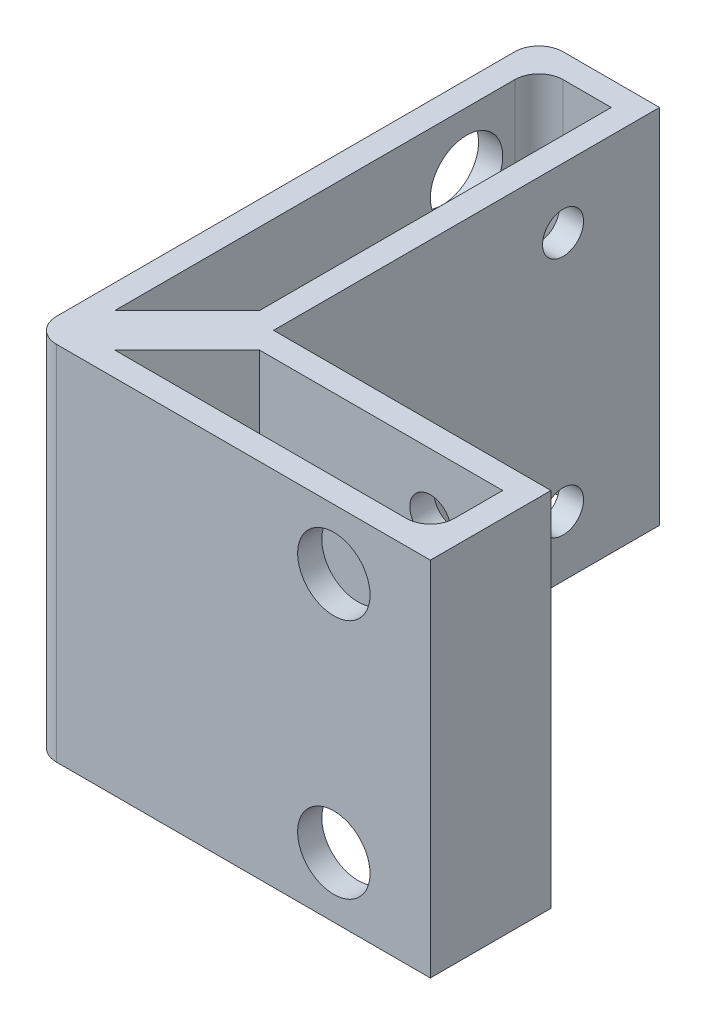
ISO-10303-21;
HEADER;
FILE_DESCRIPTION(('STEP AP214'),'2;1');
FILE_NAME('part.step','',(''),(''),'','','');
FILE_SCHEMA(('AUTOMOTIVE_DESIGN { 1 0 10303 214 1 1 1 1 }'));
ENDSEC;
DATA;
#1=APPLICATION_CONTEXT('core data for automotive mechanical design processes');
#2=APPLICATION_PROTOCOL_DEFINITION('international standard','automotive_design',2000,#1);
#3=PRODUCT_CONTEXT('',#1,'mechanical');
#4=PRODUCT('Part','Part','',(#3));
#5=PRODUCT_RELATED_PRODUCT_CATEGORY('part','',(#4));
#6=PRODUCT_DEFINITION_FORMATION('','',#4);
#7=PRODUCT_DEFINITION_CONTEXT('part definition',#1,'design');
#8=PRODUCT_DEFINITION('design','',#6,#7);
#9=PRODUCT_DEFINITION_SHAPE('','',#8);
#10=(LENGTH_UNIT() NAMED_UNIT(*) SI_UNIT(.MILLI.,.METRE.));
#11=(NAMED_UNIT(*) PLANE_ANGLE_UNIT() SI_UNIT($,.RADIAN.));
#12=(NAMED_UNIT(*) SI_UNIT($,.STERADIAN.) SOLID_ANGLE_UNIT());
#13=UNCERTAINTY_MEASURE_WITH_UNIT(LENGTH_MEASURE(1.E-05),#10,'distance_accuracy_value','');
#14=(GEOMETRIC_REPRESENTATION_CONTEXT(3) GLOBAL_UNCERTAINTY_ASSIGNED_CONTEXT((#13)) GLOBAL_UNIT_ASSIGNED_CONTEXT((#10,
#11,#12)) REPRESENTATION_CONTEXT('',''));
#15=CARTESIAN_POINT('',(0.,0.,0.));
#16=DIRECTION('',(0.,0.,1.));
#17=DIRECTION('',(1.,0.,0.));
#18=AXIS2_PLACEMENT_3D('',#15,#16,#17);
#19=CARTESIAN_POINT('',(0.,15.,0.));
#20=DIRECTION('',(1.,0.,0.));
#21=DIRECTION('',(0.,0.,-1.));
#22=AXIS2_PLACEMENT_3D('',#19,#20,#21);
#23=PLANE('',#22);
#24=CARTESIAN_POINT('',(0.,10.,-24.));
#25=DIRECTION('',(1.,0.,0.));
#26=DIRECTION('',(0.,0.,-1.));
#27=AXIS2_PLACEMENT_3D('',#24,#25,#26);
#28=CIRCLE('',#27,1.69999999999999);
#29=CARTESIAN_POINT('',(0.,10.,-25.7));
#30=VERTEX_POINT('',#29);
#31=EDGE_CURVE('E242',#30,#30,#28,.T.);
#32=ORIENTED_EDGE('',*,*,#31,.F.);
#33=EDGE_LOOP('',(#32));
#34=FACE_BOUND('',#33,.T.);
#35=CARTESIAN_POINT('',(0.,-10.,-24.));
#36=DIRECTION('',(1.,0.,0.));
#37=DIRECTION('',(0.,0.,-1.));
#38=AXIS2_PLACEMENT_3D('',#35,#36,#37);
#39=CIRCLE('',#38,1.69999999999999);
#40=CARTESIAN_POINT('',(0.,-10.,-25.7));
#41=VERTEX_POINT('',#40);
#42=EDGE_CURVE('E241',#41,#41,#39,.T.);
#43=ORIENTED_EDGE('',*,*,#42,.F.);
#44=EDGE_LOOP('',(#43));
#45=FACE_BOUND('',#44,.T.);
#46=DIRECTION('',(0.,0.,1.));
#47=VECTOR('',#46,1.);
#48=CARTESIAN_POINT('',(0.,-15.,0.));
#49=LINE('',#48,#47);
#50=CARTESIAN_POINT('',(0.,-15.,-32.));
#51=VERTEX_POINT('',#50);
#52=CARTESIAN_POINT('',(0.,-15.,0.));
#53=VERTEX_POINT('',#52);
#54=EDGE_CURVE('E333',#51,#53,#49,.T.);
#55=ORIENTED_EDGE('',*,*,#54,.F.);
#56=DIRECTION('',(0.,-1.,0.));
#57=VECTOR('',#56,1.);
#58=CARTESIAN_POINT('',(0.,15.,-32.));
#59=LINE('',#58,#57);
#60=CARTESIAN_POINT('',(0.,15.,-32.));
#61=VERTEX_POINT('',#60);
#62=EDGE_CURVE('E212',#61,#51,#59,.T.);
#63=ORIENTED_EDGE('',*,*,#62,.F.);
#64=DIRECTION('',(0.,0.,1.));
#65=VECTOR('',#64,1.);
#66=CARTESIAN_POINT('',(0.,15.,0.));
#67=LINE('',#66,#65);
#68=CARTESIAN_POINT('',(0.,15.,0.));
#69=VERTEX_POINT('',#68);
#70=EDGE_CURVE('E300',#61,#69,#67,.T.);
#71=ORIENTED_EDGE('',*,*,#70,.T.);
#72=DIRECTION('',(0.,-1.,0.));
#73=VECTOR('',#72,1.);
#74=CARTESIAN_POINT('',(0.,15.,0.));
#75=LINE('',#74,#73);
#76=EDGE_CURVE('E349',#69,#53,#75,.T.);
#77=ORIENTED_EDGE('',*,*,#76,.T.);
#78=EDGE_LOOP('',(#55,#63,#71,#77));
#79=FACE_BOUND('',#78,.T.);
#80=ADVANCED_FACE('F41',(#34,#45,#79),#23,.T.);
#81=CARTESIAN_POINT('',(0.,15.,-32.));
#82=DIRECTION('',(0.,0.,-1.));
#83=DIRECTION('',(-1.,0.,0.));
#84=AXIS2_PLACEMENT_3D('',#81,#82,#83);
#85=PLANE('',#84);
#86=DIRECTION('',(1.,0.,0.));
#87=VECTOR('',#86,1.);
#88=CARTESIAN_POINT('',(0.,-15.,-32.));
#89=LINE('',#88,#87);
#90=CARTESIAN_POINT('',(-8.,-15.,-32.));
#91=VERTEX_POINT('',#90);
#92=EDGE_CURVE('E336',#91,#51,#89,.T.);
#93=ORIENTED_EDGE('',*,*,#92,.F.);
#94=DIRECTION('',(0.,-1.,0.));
#95=VECTOR('',#94,1.);
#96=CARTESIAN_POINT('',(-8.,15.,-32.));
#97=LINE('',#96,#95);
#98=CARTESIAN_POINT('',(-8.,15.,-32.));
#99=VERTEX_POINT('',#98);
#100=EDGE_CURVE('E66',#91,#99,#97,.F.);
#101=ORIENTED_EDGE('',*,*,#100,.T.);
#102=DIRECTION('',(1.,0.,0.));
#103=VECTOR('',#102,1.);
#104=CARTESIAN_POINT('',(0.,15.,-32.));
#105=LINE('',#104,#103);
#106=EDGE_CURVE('E303',#99,#61,#105,.T.);
#107=ORIENTED_EDGE('',*,*,#106,.T.);
#108=ORIENTED_EDGE('',*,*,#62,.T.);
#109=EDGE_LOOP('',(#93,#101,#107,#108));
#110=FACE_BOUND('',#109,.T.);
#111=ADVANCED_FACE('F402',(#110),#85,.T.);
#112=CARTESIAN_POINT('',(-10.,15.,0.));
#113=DIRECTION('',(-1.,0.,0.));
#114=DIRECTION('',(0.,0.,1.));
#115=AXIS2_PLACEMENT_3D('',#112,#113,#114);
#116=PLANE('',#115);
#117=CARTESIAN_POINT('',(-10.,10.,-24.));
#118=DIRECTION('',(-1.,0.,0.));
#119=DIRECTION('',(0.,0.,1.));
#120=AXIS2_PLACEMENT_3D('',#117,#118,#119);
#121=CIRCLE('',#120,3.);
#122=CARTESIAN_POINT('',(-10.,10.,-21.));
#123=VERTEX_POINT('',#122);
#124=EDGE_CURVE('E258',#123,#123,#121,.T.);
#125=ORIENTED_EDGE('',*,*,#124,.F.);
#126=EDGE_LOOP('',(#125));
#127=FACE_BOUND('',#126,.T.);
#128=CARTESIAN_POINT('',(-10.,-10.,-24.));
#129=DIRECTION('',(-1.,0.,0.));
#130=DIRECTION('',(0.,0.,1.));
#131=AXIS2_PLACEMENT_3D('',#128,#129,#130);
#132=CIRCLE('',#131,3.);
#133=CARTESIAN_POINT('',(-10.,-10.,-21.));
#134=VERTEX_POINT('',#133);
#135=EDGE_CURVE('E249',#134,#134,#132,.T.);
#136=ORIENTED_EDGE('',*,*,#135,.F.);
#137=EDGE_LOOP('',(#136));
#138=FACE_BOUND('',#137,.T.);
#139=DIRECTION('',(0.,0.,-1.));
#140=VECTOR('',#139,1.);
#141=CARTESIAN_POINT('',(-10.,15.,0.));
#142=LINE('',#141,#140);
#143=CARTESIAN_POINT('',(-10.,15.,8.));
#144=VERTEX_POINT('',#143);
#145=CARTESIAN_POINT('',(-10.,15.,-30.));
#146=VERTEX_POINT('',#145);
#147=EDGE_CURVE('E305',#144,#146,#142,.T.);
#148=ORIENTED_EDGE('',*,*,#147,.T.);
#149=DIRECTION('',(0.,-1.,0.));
#150=VECTOR('',#149,1.);
#151=CARTESIAN_POINT('',(-10.,15.,-30.));
#152=LINE('',#151,#150);
#153=CARTESIAN_POINT('',(-10.,-15.,-30.));
#154=VERTEX_POINT('',#153);
#155=EDGE_CURVE('E220',#146,#154,#152,.T.);
#156=ORIENTED_EDGE('',*,*,#155,.T.);
#157=DIRECTION('',(0.,0.,-1.));
#158=VECTOR('',#157,1.);
#159=CARTESIAN_POINT('',(-10.,-15.,0.));
#160=LINE('',#159,#158);
#161=CARTESIAN_POINT('',(-10.,-15.,8.));
#162=VERTEX_POINT('',#161);
#163=EDGE_CURVE('E338',#162,#154,#160,.T.);
#164=ORIENTED_EDGE('',*,*,#163,.F.);
#165=DIRECTION('',(0.,-1.,0.));
#166=VECTOR('',#165,1.);
#167=CARTESIAN_POINT('',(-10.,15.,8.));
#168=LINE('',#167,#166);
#169=EDGE_CURVE('E218',#162,#144,#168,.F.);
#170=ORIENTED_EDGE('',*,*,#169,.T.);
#171=EDGE_LOOP('',(#148,#156,#164,#170));
#172=FACE_BOUND('',#171,.T.);
#173=ADVANCED_FACE('F410',(#127,#138,#172),#116,.T.);
#174=CARTESIAN_POINT('',(0.,15.,10.));
#175=DIRECTION('',(0.,0.,1.));
#176=DIRECTION('',(1.,0.,0.));
#177=AXIS2_PLACEMENT_3D('',#174,#175,#176);
#178=PLANE('',#177);
#179=CARTESIAN_POINT('',(15.,10.,10.));
#180=DIRECTION('',(0.,0.,1.));
#181=DIRECTION('',(1.,0.,0.));
#182=AXIS2_PLACEMENT_3D('',#179,#180,#181);
#183=CIRCLE('',#182,3.);
#184=CARTESIAN_POINT('',(18.,10.,10.));
#185=VERTEX_POINT('',#184);
#186=EDGE_CURVE('E245',#185,#185,#183,.T.);
#187=ORIENTED_EDGE('',*,*,#186,.F.);
#188=EDGE_LOOP('',(#187));
#189=FACE_BOUND('',#188,.T.);
#190=CARTESIAN_POINT('',(15.,-10.,10.));
#191=DIRECTION('',(0.,0.,1.));
#192=DIRECTION('',(1.,0.,0.));
#193=AXIS2_PLACEMENT_3D('',#190,#191,#192);
#194=CIRCLE('',#193,3.);
#195=CARTESIAN_POINT('',(18.,-10.,10.));
#196=VERTEX_POINT('',#195);
#197=EDGE_CURVE('E251',#196,#196,#194,.T.);
#198=ORIENTED_EDGE('',*,*,#197,.F.);
#199=EDGE_LOOP('',(#198));
#200=FACE_BOUND('',#199,.T.);
#201=DIRECTION('',(-1.,0.,0.));
#202=VECTOR('',#201,1.);
#203=CARTESIAN_POINT('',(0.,15.,10.));
#204=LINE('',#203,#202);
#205=CARTESIAN_POINT('',(23.,15.,10.));
#206=VERTEX_POINT('',#205);
#207=CARTESIAN_POINT('',(-8.,15.,10.));
#208=VERTEX_POINT('',#207);
#209=EDGE_CURVE('E308',#206,#208,#204,.T.);
#210=ORIENTED_EDGE('',*,*,#209,.T.);
#211=DIRECTION('',(0.,-1.,0.));
#212=VECTOR('',#211,1.);
#213=CARTESIAN_POINT('',(-8.,15.,10.));
#214=LINE('',#213,#212);
#215=CARTESIAN_POINT('',(-8.,-15.,10.));
#216=VERTEX_POINT('',#215);
#217=EDGE_CURVE('E231',#208,#216,#214,.T.);
#218=ORIENTED_EDGE('',*,*,#217,.T.);
#219=DIRECTION('',(-1.,0.,0.));
#220=VECTOR('',#219,1.);
#221=CARTESIAN_POINT('',(0.,-15.,10.));
#222=LINE('',#221,#220);
#223=CARTESIAN_POINT('',(23.,-15.,10.));
#224=VERTEX_POINT('',#223);
#225=EDGE_CURVE('E341',#224,#216,#222,.T.);
#226=ORIENTED_EDGE('',*,*,#225,.F.);
#227=DIRECTION('',(0.,-1.,0.));
#228=VECTOR('',#227,1.);
#229=CARTESIAN_POINT('',(23.,15.,10.));
#230=LINE('',#229,#228);
#231=EDGE_CURVE('E354',#206,#224,#230,.T.);
#232=ORIENTED_EDGE('',*,*,#231,.F.);
#233=EDGE_LOOP('',(#210,#218,#226,#232));
#234=FACE_BOUND('',#233,.T.);
#235=ADVANCED_FACE('F460',(#189,#200,#234),#178,.T.);
#236=CARTESIAN_POINT('',(23.,15.,0.));
#237=DIRECTION('',(1.,0.,0.));
#238=DIRECTION('',(0.,0.,-1.));
#239=AXIS2_PLACEMENT_3D('',#236,#237,#238);
#240=PLANE('',#239);
#241=DIRECTION('',(0.,0.,1.));
#242=VECTOR('',#241,1.);
#243=CARTESIAN_POINT('',(23.,-15.,0.));
#244=LINE('',#243,#242);
#245=CARTESIAN_POINT('',(23.,-15.,0.));
#246=VERTEX_POINT('',#245);
#247=EDGE_CURVE('E344',#246,#224,#244,.T.);
#248=ORIENTED_EDGE('',*,*,#247,.F.);
#249=DIRECTION('',(0.,-1.,0.));
#250=VECTOR('',#249,1.);
#251=CARTESIAN_POINT('',(23.,15.,0.));
#252=LINE('',#251,#250);
#253=CARTESIAN_POINT('',(23.,15.,0.));
#254=VERTEX_POINT('',#253);
#255=EDGE_CURVE('E351',#254,#246,#252,.T.);
#256=ORIENTED_EDGE('',*,*,#255,.F.);
#257=DIRECTION('',(0.,0.,1.));
#258=VECTOR('',#257,1.);
#259=CARTESIAN_POINT('',(23.,15.,0.));
#260=LINE('',#259,#258);
#261=EDGE_CURVE('E310',#254,#206,#260,.T.);
#262=ORIENTED_EDGE('',*,*,#261,.T.);
#263=ORIENTED_EDGE('',*,*,#231,.T.);
#264=EDGE_LOOP('',(#248,#256,#262,#263));
#265=FACE_BOUND('',#264,.T.);
#266=ADVANCED_FACE('F429',(#265),#240,.T.);
#267=CARTESIAN_POINT('',(1.41421356237309,15.,1.41421356237309));
#268=DIRECTION('',(-0.707106781186548,0.,-0.707106781186547));
#269=DIRECTION('',(-0.707106781186547,0.,0.707106781186548));
#270=AXIS2_PLACEMENT_3D('',#267,#268,#269);
#271=PLANE('',#270);
#272=DIRECTION('',(0.707106781186547,0.,-0.707106781186548));
#273=VECTOR('',#272,1.);
#274=CARTESIAN_POINT('',(1.41421356237309,-15.,1.41421356237309));
#275=LINE('',#274,#273);
#276=CARTESIAN_POINT('',(-5.17157287525381,-15.,8.));
#277=VERTEX_POINT('',#276);
#278=CARTESIAN_POINT('',(0.828427124746186,-15.,2.));
#279=VERTEX_POINT('',#278);
#280=EDGE_CURVE('E323',#277,#279,#275,.T.);
#281=ORIENTED_EDGE('',*,*,#280,.T.);
#282=DIRECTION('',(0.,-1.,0.));
#283=VECTOR('',#282,1.);
#284=CARTESIAN_POINT('',(0.828427124746186,15.,2.));
#285=LINE('',#284,#283);
#286=CARTESIAN_POINT('',(0.828427124746186,15.,2.));
#287=VERTEX_POINT('',#286);
#288=EDGE_CURVE('E352',#287,#279,#285,.T.);
#289=ORIENTED_EDGE('',*,*,#288,.F.);
#290=DIRECTION('',(0.707106781186547,0.,-0.707106781186548));
#291=VECTOR('',#290,1.);
#292=CARTESIAN_POINT('',(1.41421356237309,15.,1.41421356237309));
#293=LINE('',#292,#291);
#294=CARTESIAN_POINT('',(-5.17157287525381,15.,8.));
#295=VERTEX_POINT('',#294);
#296=EDGE_CURVE('E290',#295,#287,#293,.T.);
#297=ORIENTED_EDGE('',*,*,#296,.F.);
#298=DIRECTION('',(0.,-1.,0.));
#299=VECTOR('',#298,1.);
#300=CARTESIAN_POINT('',(-5.17157287525381,15.,8.));
#301=LINE('',#300,#299);
#302=EDGE_CURVE('E197',#295,#277,#301,.T.);
#303=ORIENTED_EDGE('',*,*,#302,.T.);
#304=EDGE_LOOP('',(#281,#289,#297,#303));
#305=FACE_BOUND('',#304,.T.);
#306=ADVANCED_FACE('F426',(#305),#271,.F.);
#307=CARTESIAN_POINT('',(0.,15.,2.));
#308=DIRECTION('',(0.,0.,-1.));
#309=DIRECTION('',(-1.,0.,0.));
#310=AXIS2_PLACEMENT_3D('',#307,#308,#309);
#311=PLANE('',#310);
#312=DIRECTION('',(1.,0.,0.));
#313=VECTOR('',#312,1.);
#314=CARTESIAN_POINT('',(0.,-15.,2.));
#315=LINE('',#314,#313);
#316=CARTESIAN_POINT('',(21.,-15.,2.));
#317=VERTEX_POINT('',#316);
#318=EDGE_CURVE('E326',#279,#317,#315,.T.);
#319=ORIENTED_EDGE('',*,*,#318,.T.);
#320=DIRECTION('',(0.,-1.,0.));
#321=VECTOR('',#320,1.);
#322=CARTESIAN_POINT('',(21.,15.,2.));
#323=LINE('',#322,#321);
#324=CARTESIAN_POINT('',(21.,15.,2.));
#325=VERTEX_POINT('',#324);
#326=EDGE_CURVE('E201',#325,#317,#323,.T.);
#327=ORIENTED_EDGE('',*,*,#326,.F.);
#328=DIRECTION('',(1.,0.,0.));
#329=VECTOR('',#328,1.);
#330=CARTESIAN_POINT('',(0.,15.,2.));
#331=LINE('',#330,#329);
#332=EDGE_CURVE('E293',#287,#325,#331,.T.);
#333=ORIENTED_EDGE('',*,*,#332,.F.);
#334=ORIENTED_EDGE('',*,*,#288,.T.);
#335=EDGE_LOOP('',(#319,#327,#333,#334));
#336=FACE_BOUND('',#335,.T.);
#337=CARTESIAN_POINT('',(15.,-10.,2.));
#338=DIRECTION('',(0.,0.,-1.));
#339=DIRECTION('',(-1.,0.,0.));
#340=AXIS2_PLACEMENT_3D('',#337,#338,#339);
#341=CIRCLE('',#340,1.69999999999999);
#342=CARTESIAN_POINT('',(13.3,-10.,2.));
#343=VERTEX_POINT('',#342);
#344=EDGE_CURVE('E285',#343,#343,#341,.T.);
#345=ORIENTED_EDGE('',*,*,#344,.T.);
#346=EDGE_LOOP('',(#345));
#347=FACE_BOUND('',#346,.T.);
#348=CARTESIAN_POINT('',(15.,10.,2.));
#349=DIRECTION('',(0.,0.,-1.));
#350=DIRECTION('',(-1.,0.,0.));
#351=AXIS2_PLACEMENT_3D('',#348,#349,#350);
#352=CIRCLE('',#351,1.69999999999999);
#353=CARTESIAN_POINT('',(13.3,10.,2.));
#354=VERTEX_POINT('',#353);
#355=EDGE_CURVE('E279',#354,#354,#352,.T.);
#356=ORIENTED_EDGE('',*,*,#355,.T.);
#357=EDGE_LOOP('',(#356));
#358=FACE_BOUND('',#357,.T.);
#359=ADVANCED_FACE('F422',(#336,#347,#358),#311,.F.);
#360=CARTESIAN_POINT('',(21.,15.,0.));
#361=DIRECTION('',(1.,0.,0.));
#362=DIRECTION('',(0.,0.,-1.));
#363=AXIS2_PLACEMENT_3D('',#360,#361,#362);
#364=PLANE('',#363);
#365=DIRECTION('',(0.,0.,1.));
#366=VECTOR('',#365,1.);
#367=CARTESIAN_POINT('',(21.,-15.,0.));
#368=LINE('',#367,#366);
#369=CARTESIAN_POINT('',(21.,-15.,6.));
#370=VERTEX_POINT('',#369);
#371=EDGE_CURVE('E328',#317,#370,#368,.T.);
#372=ORIENTED_EDGE('',*,*,#371,.T.);
#373=DIRECTION('',(0.,-1.,0.));
#374=VECTOR('',#373,1.);
#375=CARTESIAN_POINT('',(21.,15.,6.));
#376=LINE('',#375,#374);
#377=CARTESIAN_POINT('',(21.,15.,6.));
#378=VERTEX_POINT('',#377);
#379=EDGE_CURVE('E211',#370,#378,#376,.F.);
#380=ORIENTED_EDGE('',*,*,#379,.T.);
#381=DIRECTION('',(0.,0.,1.));
#382=VECTOR('',#381,1.);
#383=CARTESIAN_POINT('',(21.,15.,0.));
#384=LINE('',#383,#382);
#385=EDGE_CURVE('E295',#325,#378,#384,.T.);
#386=ORIENTED_EDGE('',*,*,#385,.F.);
#387=ORIENTED_EDGE('',*,*,#326,.T.);
#388=EDGE_LOOP('',(#372,#380,#386,#387));
#389=FACE_BOUND('',#388,.T.);
#390=ADVANCED_FACE('F419',(#389),#364,.F.);
#391=CARTESIAN_POINT('',(-1.4142135623731,15.,-1.4142135623731));
#392=DIRECTION('',(0.707106781186547,0.,0.707106781186548));
#393=DIRECTION('',(0.707106781186548,0.,-0.707106781186547));
#394=AXIS2_PLACEMENT_3D('',#391,#392,#393);
#395=PLANE('',#394);
#396=DIRECTION('',(-0.707106781186548,0.,0.707106781186547));
#397=VECTOR('',#396,1.);
#398=CARTESIAN_POINT('',(-1.4142135623731,-15.,-1.4142135623731));
#399=LINE('',#398,#397);
#400=CARTESIAN_POINT('',(-2.,-15.,-0.828427124746191));
#401=VERTEX_POINT('',#400);
#402=CARTESIAN_POINT('',(-8.,-15.,5.17157287525381));
#403=VERTEX_POINT('',#402);
#404=EDGE_CURVE('E196',#401,#403,#399,.T.);
#405=ORIENTED_EDGE('',*,*,#404,.T.);
#406=DIRECTION('',(0.,-1.,0.));
#407=VECTOR('',#406,1.);
#408=CARTESIAN_POINT('',(-8.,15.,5.17157287525381));
#409=LINE('',#408,#407);
#410=CARTESIAN_POINT('',(-8.,15.,5.17157287525381));
#411=VERTEX_POINT('',#410);
#412=EDGE_CURVE('E175',#411,#403,#409,.T.);
#413=ORIENTED_EDGE('',*,*,#412,.F.);
#414=DIRECTION('',(-0.707106781186548,0.,0.707106781186547));
#415=VECTOR('',#414,1.);
#416=CARTESIAN_POINT('',(-1.4142135623731,15.,-1.4142135623731));
#417=LINE('',#416,#415);
#418=CARTESIAN_POINT('',(-2.,15.,-0.828427124746191));
#419=VERTEX_POINT('',#418);
#420=EDGE_CURVE('E182',#419,#411,#417,.T.);
#421=ORIENTED_EDGE('',*,*,#420,.F.);
#422=DIRECTION('',(0.,-1.,0.));
#423=VECTOR('',#422,1.);
#424=CARTESIAN_POINT('',(-2.,15.,-0.828427124746191));
#425=LINE('',#424,#423);
#426=EDGE_CURVE('E204',#419,#401,#425,.T.);
#427=ORIENTED_EDGE('',*,*,#426,.T.);
#428=EDGE_LOOP('',(#405,#413,#421,#427));
#429=FACE_BOUND('',#428,.T.);
#430=ADVANCED_FACE('F194',(#429),#395,.F.);
#431=CARTESIAN_POINT('',(-8.,15.,0.));
#432=DIRECTION('',(-1.,0.,0.));
#433=DIRECTION('',(0.,0.,1.));
#434=AXIS2_PLACEMENT_3D('',#431,#432,#433);
#435=PLANE('',#434);
#436=CARTESIAN_POINT('',(-8.,10.,-24.));
#437=DIRECTION('',(-1.,0.,0.));
#438=DIRECTION('',(0.,0.,1.));
#439=AXIS2_PLACEMENT_3D('',#436,#437,#438);
#440=CIRCLE('',#439,3.);
#441=CARTESIAN_POINT('',(-8.,10.,-21.));
#442=VERTEX_POINT('',#441);
#443=EDGE_CURVE('E266',#442,#442,#440,.T.);
#444=ORIENTED_EDGE('',*,*,#443,.T.);
#445=EDGE_LOOP('',(#444));
#446=FACE_BOUND('',#445,.T.);
#447=CARTESIAN_POINT('',(-8.,-10.,-24.));
#448=DIRECTION('',(-1.,0.,0.));
#449=DIRECTION('',(0.,0.,1.));
#450=AXIS2_PLACEMENT_3D('',#447,#448,#449);
#451=CIRCLE('',#450,3.);
#452=CARTESIAN_POINT('',(-8.,-10.,-21.));
#453=VERTEX_POINT('',#452);
#454=EDGE_CURVE('E261',#453,#453,#451,.T.);
#455=ORIENTED_EDGE('',*,*,#454,.T.);
#456=EDGE_LOOP('',(#455));
#457=FACE_BOUND('',#456,.T.);
#458=DIRECTION('',(0.,0.,-1.));
#459=VECTOR('',#458,1.);
#460=CARTESIAN_POINT('',(-8.,-15.,0.));
#461=LINE('',#460,#459);
#462=CARTESIAN_POINT('',(-8.,-15.,-28.));
#463=VERTEX_POINT('',#462);
#464=EDGE_CURVE('E317',#403,#463,#461,.T.);
#465=ORIENTED_EDGE('',*,*,#464,.T.);
#466=DIRECTION('',(0.,-1.,0.));
#467=VECTOR('',#466,1.);
#468=CARTESIAN_POINT('',(-8.,15.,-28.));
#469=LINE('',#468,#467);
#470=CARTESIAN_POINT('',(-8.,15.,-28.));
#471=VERTEX_POINT('',#470);
#472=EDGE_CURVE('E178',#463,#471,#469,.F.);
#473=ORIENTED_EDGE('',*,*,#472,.T.);
#474=DIRECTION('',(0.,0.,-1.));
#475=VECTOR('',#474,1.);
#476=CARTESIAN_POINT('',(-8.,15.,0.));
#477=LINE('',#476,#475);
#478=EDGE_CURVE('E170',#411,#471,#477,.T.);
#479=ORIENTED_EDGE('',*,*,#478,.F.);
#480=ORIENTED_EDGE('',*,*,#412,.T.);
#481=EDGE_LOOP('',(#465,#473,#479,#480));
#482=FACE_BOUND('',#481,.T.);
#483=ADVANCED_FACE('F173',(#446,#457,#482),#435,.F.);
#484=CARTESIAN_POINT('',(0.,15.,-30.));
#485=DIRECTION('',(0.,0.,-1.));
#486=DIRECTION('',(-1.,0.,0.));
#487=AXIS2_PLACEMENT_3D('',#484,#485,#486);
#488=PLANE('',#487);
#489=DIRECTION('',(1.,0.,0.));
#490=VECTOR('',#489,1.);
#491=CARTESIAN_POINT('',(0.,15.,-30.));
#492=LINE('',#491,#490);
#493=CARTESIAN_POINT('',(-6.,15.,-30.));
#494=VERTEX_POINT('',#493);
#495=CARTESIAN_POINT('',(-2.,15.,-30.));
#496=VERTEX_POINT('',#495);
#497=EDGE_CURVE('E181',#494,#496,#492,.T.);
#498=ORIENTED_EDGE('',*,*,#497,.F.);
#499=DIRECTION('',(0.,-1.,0.));
#500=VECTOR('',#499,1.);
#501=CARTESIAN_POINT('',(-6.,-15.,-30.));
#502=LINE('',#501,#500);
#503=CARTESIAN_POINT('',(-6.,-15.,-30.));
#504=VERTEX_POINT('',#503);
#505=EDGE_CURVE('E214',#494,#504,#502,.T.);
#506=ORIENTED_EDGE('',*,*,#505,.T.);
#507=DIRECTION('',(1.,0.,0.));
#508=VECTOR('',#507,1.);
#509=CARTESIAN_POINT('',(0.,-15.,-30.));
#510=LINE('',#509,#508);
#511=CARTESIAN_POINT('',(-2.,-15.,-30.));
#512=VERTEX_POINT('',#511);
#513=EDGE_CURVE('E319',#504,#512,#510,.T.);
#514=ORIENTED_EDGE('',*,*,#513,.T.);
#515=DIRECTION('',(0.,-1.,0.));
#516=VECTOR('',#515,1.);
#517=CARTESIAN_POINT('',(-2.,15.,-30.));
#518=LINE('',#517,#516);
#519=EDGE_CURVE('E198',#496,#512,#518,.T.);
#520=ORIENTED_EDGE('',*,*,#519,.F.);
#521=EDGE_LOOP('',(#498,#506,#514,#520));
#522=FACE_BOUND('',#521,.T.);
#523=ADVANCED_FACE('F373',(#522),#488,.F.);
#524=CARTESIAN_POINT('',(0.,15.,8.));
#525=DIRECTION('',(0.,0.,1.));
#526=DIRECTION('',(1.,0.,0.));
#527=AXIS2_PLACEMENT_3D('',#524,#525,#526);
#528=PLANE('',#527);
#529=CARTESIAN_POINT('',(15.,10.,8.));
#530=DIRECTION('',(0.,0.,1.));
#531=DIRECTION('',(1.,0.,0.));
#532=AXIS2_PLACEMENT_3D('',#529,#530,#531);
#533=CIRCLE('',#532,3.);
#534=CARTESIAN_POINT('',(18.,10.,8.));
#535=VERTEX_POINT('',#534);
#536=EDGE_CURVE('E45',#535,#535,#533,.T.);
#537=ORIENTED_EDGE('',*,*,#536,.T.);
#538=EDGE_LOOP('',(#537));
#539=FACE_BOUND('',#538,.T.);
#540=CARTESIAN_POINT('',(15.,-10.,8.));
#541=DIRECTION('',(0.,0.,1.));
#542=DIRECTION('',(1.,0.,0.));
#543=AXIS2_PLACEMENT_3D('',#540,#541,#542);
#544=CIRCLE('',#543,3.);
#545=CARTESIAN_POINT('',(18.,-10.,8.));
#546=VERTEX_POINT('',#545);
#547=EDGE_CURVE('E243',#546,#546,#544,.T.);
#548=ORIENTED_EDGE('',*,*,#547,.T.);
#549=EDGE_LOOP('',(#548));
#550=FACE_BOUND('',#549,.T.);
#551=DIRECTION('',(-1.,0.,0.));
#552=VECTOR('',#551,1.);
#553=CARTESIAN_POINT('',(0.,15.,8.));
#554=LINE('',#553,#552);
#555=CARTESIAN_POINT('',(19.,15.,8.));
#556=VERTEX_POINT('',#555);
#557=EDGE_CURVE('E298',#556,#295,#554,.T.);
#558=ORIENTED_EDGE('',*,*,#557,.F.);
#559=DIRECTION('',(0.,-1.,0.));
#560=VECTOR('',#559,1.);
#561=CARTESIAN_POINT('',(19.,-15.,8.));
#562=LINE('',#561,#560);
#563=CARTESIAN_POINT('',(19.,-15.,8.));
#564=VERTEX_POINT('',#563);
#565=EDGE_CURVE('E208',#556,#564,#562,.T.);
#566=ORIENTED_EDGE('',*,*,#565,.T.);
#567=DIRECTION('',(-1.,0.,0.));
#568=VECTOR('',#567,1.);
#569=CARTESIAN_POINT('',(0.,-15.,8.));
#570=LINE('',#569,#568);
#571=EDGE_CURVE('E331',#564,#277,#570,.T.);
#572=ORIENTED_EDGE('',*,*,#571,.T.);
#573=ORIENTED_EDGE('',*,*,#302,.F.);
#574=EDGE_LOOP('',(#558,#566,#572,#573));
#575=FACE_BOUND('',#574,.T.);
#576=ADVANCED_FACE('F378',(#539,#550,#575),#528,.F.);
#577=CARTESIAN_POINT('',(-2.,15.,0.));
#578=DIRECTION('',(1.,0.,0.));
#579=DIRECTION('',(0.,0.,-1.));
#580=AXIS2_PLACEMENT_3D('',#577,#578,#579);
#581=PLANE('',#580);
#582=DIRECTION('',(0.,0.,1.));
#583=VECTOR('',#582,1.);
#584=CARTESIAN_POINT('',(-2.,-15.,0.));
#585=LINE('',#584,#583);
#586=EDGE_CURVE('E321',#512,#401,#585,.T.);
#587=ORIENTED_EDGE('',*,*,#586,.T.);
#588=ORIENTED_EDGE('',*,*,#426,.F.);
#589=DIRECTION('',(0.,0.,1.));
#590=VECTOR('',#589,1.);
#591=CARTESIAN_POINT('',(-2.,15.,0.));
#592=LINE('',#591,#590);
#593=EDGE_CURVE('E188',#496,#419,#592,.T.);
#594=ORIENTED_EDGE('',*,*,#593,.F.);
#595=ORIENTED_EDGE('',*,*,#519,.T.);
#596=EDGE_LOOP('',(#587,#588,#594,#595));
#597=FACE_BOUND('',#596,.T.);
#598=CARTESIAN_POINT('',(-2.,-10.,-24.));
#599=DIRECTION('',(1.,0.,0.));
#600=DIRECTION('',(0.,0.,-1.));
#601=AXIS2_PLACEMENT_3D('',#598,#599,#600);
#602=CIRCLE('',#601,1.69999999999999);
#603=CARTESIAN_POINT('',(-2.,-10.,-25.7));
#604=VERTEX_POINT('',#603);
#605=EDGE_CURVE('E273',#604,#604,#602,.T.);
#606=ORIENTED_EDGE('',*,*,#605,.T.);
#607=EDGE_LOOP('',(#606));
#608=FACE_BOUND('',#607,.T.);
#609=CARTESIAN_POINT('',(-2.,10.,-24.));
#610=DIRECTION('',(1.,0.,0.));
#611=DIRECTION('',(0.,0.,-1.));
#612=AXIS2_PLACEMENT_3D('',#609,#610,#611);
#613=CIRCLE('',#612,1.69999999999999);
#614=CARTESIAN_POINT('',(-2.,10.,-25.7));
#615=VERTEX_POINT('',#614);
#616=EDGE_CURVE('E239',#615,#615,#613,.T.);
#617=ORIENTED_EDGE('',*,*,#616,.T.);
#618=EDGE_LOOP('',(#617));
#619=FACE_BOUND('',#618,.T.);
#620=ADVANCED_FACE('F374',(#597,#608,#619),#581,.F.);
#621=CARTESIAN_POINT('',(0.,15.,0.));
#622=DIRECTION('',(0.,0.,-1.));
#623=DIRECTION('',(-1.,0.,0.));
#624=AXIS2_PLACEMENT_3D('',#621,#622,#623);
#625=PLANE('',#624);
#626=CARTESIAN_POINT('',(15.,10.,0.));
#627=DIRECTION('',(0.,0.,-1.));
#628=DIRECTION('',(-1.,0.,0.));
#629=AXIS2_PLACEMENT_3D('',#626,#627,#628);
#630=CIRCLE('',#629,1.69999999999999);
#631=CARTESIAN_POINT('',(13.3,10.,0.));
#632=VERTEX_POINT('',#631);
#633=EDGE_CURVE('E276',#632,#632,#630,.T.);
#634=ORIENTED_EDGE('',*,*,#633,.F.);
#635=EDGE_LOOP('',(#634));
#636=FACE_BOUND('',#635,.T.);
#637=CARTESIAN_POINT('',(15.,-10.,0.));
#638=DIRECTION('',(0.,0.,-1.));
#639=DIRECTION('',(-1.,0.,0.));
#640=AXIS2_PLACEMENT_3D('',#637,#638,#639);
#641=CIRCLE('',#640,1.69999999999999);
#642=CARTESIAN_POINT('',(13.3,-10.,0.));
#643=VERTEX_POINT('',#642);
#644=EDGE_CURVE('E282',#643,#643,#641,.T.);
#645=ORIENTED_EDGE('',*,*,#644,.F.);
#646=EDGE_LOOP('',(#645));
#647=FACE_BOUND('',#646,.T.);
#648=DIRECTION('',(1.,0.,0.));
#649=VECTOR('',#648,1.);
#650=CARTESIAN_POINT('',(0.,-15.,0.));
#651=LINE('',#650,#649);
#652=EDGE_CURVE('E192',#53,#246,#651,.T.);
#653=ORIENTED_EDGE('',*,*,#652,.F.);
#654=ORIENTED_EDGE('',*,*,#76,.F.);
#655=DIRECTION('',(1.,0.,0.));
#656=VECTOR('',#655,1.);
#657=CARTESIAN_POINT('',(0.,15.,0.));
#658=LINE('',#657,#656);
#659=EDGE_CURVE('E313',#69,#254,#658,.T.);
#660=ORIENTED_EDGE('',*,*,#659,.T.);
#661=ORIENTED_EDGE('',*,*,#255,.T.);
#662=EDGE_LOOP('',(#653,#654,#660,#661));
#663=FACE_BOUND('',#662,.T.);
#664=ADVANCED_FACE('F377',(#636,#647,#663),#625,.T.);
#665=CARTESIAN_POINT('',(0.,15.,0.));
#666=DIRECTION('',(0.,1.,0.));
#667=DIRECTION('',(0.,0.,1.));
#668=AXIS2_PLACEMENT_3D('',#665,#666,#667);
#669=PLANE('',#668);
#670=ORIENTED_EDGE('',*,*,#420,.T.);
#671=ORIENTED_EDGE('',*,*,#478,.T.);
#672=CARTESIAN_POINT('',(-6.,15.,-28.));
#673=DIRECTION('',(0.,1.,0.));
#674=DIRECTION('',(0.,0.,1.));
#675=AXIS2_PLACEMENT_3D('',#672,#673,#674);
#676=CIRCLE('',#675,2.);
#677=EDGE_CURVE('E11',#471,#494,#676,.F.);
#678=ORIENTED_EDGE('',*,*,#677,.T.);
#679=ORIENTED_EDGE('',*,*,#497,.T.);
#680=ORIENTED_EDGE('',*,*,#593,.T.);
#681=EDGE_LOOP('',(#670,#671,#678,#679,#680));
#682=FACE_BOUND('',#681,.T.);
#683=ORIENTED_EDGE('',*,*,#296,.T.);
#684=ORIENTED_EDGE('',*,*,#332,.T.);
#685=ORIENTED_EDGE('',*,*,#385,.T.);
#686=CARTESIAN_POINT('',(19.,15.,6.));
#687=DIRECTION('',(0.,1.,0.));
#688=DIRECTION('',(0.,0.,1.));
#689=AXIS2_PLACEMENT_3D('',#686,#687,#688);
#690=CIRCLE('',#689,2.);
#691=EDGE_CURVE('E236',#378,#556,#690,.F.);
#692=ORIENTED_EDGE('',*,*,#691,.T.);
#693=ORIENTED_EDGE('',*,*,#557,.T.);
#694=EDGE_LOOP('',(#683,#684,#685,#692,#693));
#695=FACE_BOUND('',#694,.T.);
#696=ORIENTED_EDGE('',*,*,#106,.F.);
#697=CARTESIAN_POINT('',(-8.,15.,-30.));
#698=DIRECTION('',(0.,1.,0.));
#699=DIRECTION('',(0.,0.,1.));
#700=AXIS2_PLACEMENT_3D('',#697,#698,#699);
#701=CIRCLE('',#700,2.);
#702=EDGE_CURVE('E229',#99,#146,#701,.T.);
#703=ORIENTED_EDGE('',*,*,#702,.T.);
#704=ORIENTED_EDGE('',*,*,#147,.F.);
#705=CARTESIAN_POINT('',(-8.,15.,8.));
#706=DIRECTION('',(0.,1.,0.));
#707=DIRECTION('',(0.,0.,1.));
#708=AXIS2_PLACEMENT_3D('',#705,#706,#707);
#709=CIRCLE('',#708,2.);
#710=EDGE_CURVE('E58',#144,#208,#709,.T.);
#711=ORIENTED_EDGE('',*,*,#710,.T.);
#712=ORIENTED_EDGE('',*,*,#209,.F.);
#713=ORIENTED_EDGE('',*,*,#261,.F.);
#714=ORIENTED_EDGE('',*,*,#659,.F.);
#715=ORIENTED_EDGE('',*,*,#70,.F.);
#716=EDGE_LOOP('',(#696,#703,#704,#711,#712,#713,#714,#715));
#717=FACE_BOUND('',#716,.T.);
#718=ADVANCED_FACE('F185',(#682,#695,#717),#669,.T.);
#719=CARTESIAN_POINT('',(0.,-15.,0.));
#720=DIRECTION('',(0.,1.,0.));
#721=DIRECTION('',(0.,0.,1.));
#722=AXIS2_PLACEMENT_3D('',#719,#720,#721);
#723=PLANE('',#722);
#724=ORIENTED_EDGE('',*,*,#404,.F.);
#725=ORIENTED_EDGE('',*,*,#586,.F.);
#726=ORIENTED_EDGE('',*,*,#513,.F.);
#727=CARTESIAN_POINT('',(-6.,-15.,-28.));
#728=DIRECTION('',(0.,1.,0.));
#729=DIRECTION('',(0.,0.,1.));
#730=AXIS2_PLACEMENT_3D('',#727,#728,#729);
#731=CIRCLE('',#730,2.);
#732=EDGE_CURVE('E50',#504,#463,#731,.T.);
#733=ORIENTED_EDGE('',*,*,#732,.T.);
#734=ORIENTED_EDGE('',*,*,#464,.F.);
#735=EDGE_LOOP('',(#724,#725,#726,#733,#734));
#736=FACE_BOUND('',#735,.T.);
#737=ORIENTED_EDGE('',*,*,#280,.F.);
#738=ORIENTED_EDGE('',*,*,#571,.F.);
#739=CARTESIAN_POINT('',(19.,-15.,6.));
#740=DIRECTION('',(0.,1.,0.));
#741=DIRECTION('',(0.,0.,1.));
#742=AXIS2_PLACEMENT_3D('',#739,#740,#741);
#743=CIRCLE('',#742,2.);
#744=EDGE_CURVE('E234',#564,#370,#743,.T.);
#745=ORIENTED_EDGE('',*,*,#744,.T.);
#746=ORIENTED_EDGE('',*,*,#371,.F.);
#747=ORIENTED_EDGE('',*,*,#318,.F.);
#748=EDGE_LOOP('',(#737,#738,#745,#746,#747));
#749=FACE_BOUND('',#748,.T.);
#750=ORIENTED_EDGE('',*,*,#163,.T.);
#751=CARTESIAN_POINT('',(-8.,-15.,-30.));
#752=DIRECTION('',(0.,1.,0.));
#753=DIRECTION('',(0.,0.,1.));
#754=AXIS2_PLACEMENT_3D('',#751,#752,#753);
#755=CIRCLE('',#754,2.);
#756=EDGE_CURVE('E225',#154,#91,#755,.F.);
#757=ORIENTED_EDGE('',*,*,#756,.T.);
#758=ORIENTED_EDGE('',*,*,#92,.T.);
#759=ORIENTED_EDGE('',*,*,#54,.T.);
#760=ORIENTED_EDGE('',*,*,#652,.T.);
#761=ORIENTED_EDGE('',*,*,#247,.T.);
#762=ORIENTED_EDGE('',*,*,#225,.T.);
#763=CARTESIAN_POINT('',(-8.,-15.,8.));
#764=DIRECTION('',(0.,1.,0.));
#765=DIRECTION('',(0.,0.,1.));
#766=AXIS2_PLACEMENT_3D('',#763,#764,#765);
#767=CIRCLE('',#766,2.);
#768=EDGE_CURVE('E223',#216,#162,#767,.F.);
#769=ORIENTED_EDGE('',*,*,#768,.T.);
#770=EDGE_LOOP('',(#750,#757,#758,#759,#760,#761,#762,#769));
#771=FACE_BOUND('',#770,.T.);
#772=ADVANCED_FACE('F364',(#736,#749,#771),#723,.F.);
#773=CARTESIAN_POINT('',(19.,15.,6.));
#774=DIRECTION('',(0.,1.,0.));
#775=DIRECTION('',(0.,0.,1.));
#776=AXIS2_PLACEMENT_3D('',#773,#774,#775);
#777=CYLINDRICAL_SURFACE('',#776,2.);
#778=ORIENTED_EDGE('',*,*,#691,.F.);
#779=ORIENTED_EDGE('',*,*,#379,.F.);
#780=ORIENTED_EDGE('',*,*,#744,.F.);
#781=ORIENTED_EDGE('',*,*,#565,.F.);
#782=EDGE_LOOP('',(#778,#779,#780,#781));
#783=FACE_BOUND('',#782,.T.);
#784=ADVANCED_FACE('F439',(#783),#777,.F.);
#785=CARTESIAN_POINT('',(-6.,15.,-28.));
#786=DIRECTION('',(0.,1.,0.));
#787=DIRECTION('',(0.,0.,1.));
#788=AXIS2_PLACEMENT_3D('',#785,#786,#787);
#789=CYLINDRICAL_SURFACE('',#788,2.);
#790=ORIENTED_EDGE('',*,*,#677,.F.);
#791=ORIENTED_EDGE('',*,*,#472,.F.);
#792=ORIENTED_EDGE('',*,*,#732,.F.);
#793=ORIENTED_EDGE('',*,*,#505,.F.);
#794=EDGE_LOOP('',(#790,#791,#792,#793));
#795=FACE_BOUND('',#794,.T.);
#796=ADVANCED_FACE('F368',(#795),#789,.F.);
#797=CARTESIAN_POINT('',(-8.,15.,-30.));
#798=DIRECTION('',(0.,-1.,0.));
#799=DIRECTION('',(0.,0.,-1.));
#800=AXIS2_PLACEMENT_3D('',#797,#798,#799);
#801=CYLINDRICAL_SURFACE('',#800,2.);
#802=ORIENTED_EDGE('',*,*,#702,.F.);
#803=ORIENTED_EDGE('',*,*,#100,.F.);
#804=ORIENTED_EDGE('',*,*,#756,.F.);
#805=ORIENTED_EDGE('',*,*,#155,.F.);
#806=EDGE_LOOP('',(#802,#803,#804,#805));
#807=FACE_BOUND('',#806,.T.);
#808=ADVANCED_FACE('F444',(#807),#801,.T.);
#809=CARTESIAN_POINT('',(-8.,15.,8.));
#810=DIRECTION('',(0.,-1.,0.));
#811=DIRECTION('',(0.,0.,-1.));
#812=AXIS2_PLACEMENT_3D('',#809,#810,#811);
#813=CYLINDRICAL_SURFACE('',#812,2.);
#814=ORIENTED_EDGE('',*,*,#710,.F.);
#815=ORIENTED_EDGE('',*,*,#169,.F.);
#816=ORIENTED_EDGE('',*,*,#768,.F.);
#817=ORIENTED_EDGE('',*,*,#217,.F.);
#818=EDGE_LOOP('',(#814,#815,#816,#817));
#819=FACE_BOUND('',#818,.T.);
#820=ADVANCED_FACE('F43',(#819),#813,.T.);
#821=CARTESIAN_POINT('',(15.,-10.,0.));
#822=DIRECTION('',(0.,0.,-1.));
#823=DIRECTION('',(-1.,0.,0.));
#824=AXIS2_PLACEMENT_3D('',#821,#822,#823);
#825=CYLINDRICAL_SURFACE('',#824,1.69999999999999);
#826=ORIENTED_EDGE('',*,*,#644,.T.);
#827=EDGE_LOOP('',(#826));
#828=FACE_BOUND('',#827,.T.);
#829=ORIENTED_EDGE('',*,*,#344,.F.);
#830=EDGE_LOOP('',(#829));
#831=FACE_BOUND('',#830,.T.);
#832=ADVANCED_FACE('F449',(#828,#831),#825,.F.);
#833=CARTESIAN_POINT('',(15.,10.,0.));
#834=DIRECTION('',(0.,0.,-1.));
#835=DIRECTION('',(-1.,0.,0.));
#836=AXIS2_PLACEMENT_3D('',#833,#834,#835);
#837=CYLINDRICAL_SURFACE('',#836,1.69999999999999);
#838=ORIENTED_EDGE('',*,*,#633,.T.);
#839=EDGE_LOOP('',(#838));
#840=FACE_BOUND('',#839,.T.);
#841=ORIENTED_EDGE('',*,*,#355,.F.);
#842=EDGE_LOOP('',(#841));
#843=FACE_BOUND('',#842,.T.);
#844=ADVANCED_FACE('F398',(#840,#843),#837,.F.);
#845=CARTESIAN_POINT('',(0.,-10.,-24.));
#846=DIRECTION('',(1.,0.,0.));
#847=DIRECTION('',(0.,0.,-1.));
#848=AXIS2_PLACEMENT_3D('',#845,#846,#847);
#849=CYLINDRICAL_SURFACE('',#848,1.69999999999999);
#850=ORIENTED_EDGE('',*,*,#42,.T.);
#851=EDGE_LOOP('',(#850));
#852=FACE_BOUND('',#851,.T.);
#853=ORIENTED_EDGE('',*,*,#605,.F.);
#854=EDGE_LOOP('',(#853));
#855=FACE_BOUND('',#854,.T.);
#856=ADVANCED_FACE('F387',(#852,#855),#849,.F.);
#857=CARTESIAN_POINT('',(0.,10.,-24.));
#858=DIRECTION('',(1.,0.,0.));
#859=DIRECTION('',(0.,0.,-1.));
#860=AXIS2_PLACEMENT_3D('',#857,#858,#859);
#861=CYLINDRICAL_SURFACE('',#860,1.69999999999999);
#862=ORIENTED_EDGE('',*,*,#31,.T.);
#863=EDGE_LOOP('',(#862));
#864=FACE_BOUND('',#863,.T.);
#865=ORIENTED_EDGE('',*,*,#616,.F.);
#866=EDGE_LOOP('',(#865));
#867=FACE_BOUND('',#866,.T.);
#868=ADVANCED_FACE('F384',(#864,#867),#861,.F.);
#869=CARTESIAN_POINT('',(6.48528137423857,-10.,-24.));
#870=DIRECTION('',(-1.,0.,0.));
#871=DIRECTION('',(0.,0.,1.));
#872=AXIS2_PLACEMENT_3D('',#869,#870,#871);
#873=CYLINDRICAL_SURFACE('',#872,3.);
#874=ORIENTED_EDGE('',*,*,#135,.T.);
#875=EDGE_LOOP('',(#874));
#876=FACE_BOUND('',#875,.T.);
#877=ORIENTED_EDGE('',*,*,#454,.F.);
#878=EDGE_LOOP('',(#877));
#879=FACE_BOUND('',#878,.T.);
#880=ADVANCED_FACE('F386',(#876,#879),#873,.F.);
#881=CARTESIAN_POINT('',(6.48528137423857,10.,-24.));
#882=DIRECTION('',(-1.,0.,0.));
#883=DIRECTION('',(0.,0.,1.));
#884=AXIS2_PLACEMENT_3D('',#881,#882,#883);
#885=CYLINDRICAL_SURFACE('',#884,3.);
#886=ORIENTED_EDGE('',*,*,#124,.T.);
#887=EDGE_LOOP('',(#886));
#888=FACE_BOUND('',#887,.T.);
#889=ORIENTED_EDGE('',*,*,#443,.F.);
#890=EDGE_LOOP('',(#889));
#891=FACE_BOUND('',#890,.T.);
#892=ADVANCED_FACE('F395',(#888,#891),#885,.F.);
#893=CARTESIAN_POINT('',(15.,-10.,-6.48528137423857));
#894=DIRECTION('',(0.,0.,1.));
#895=DIRECTION('',(1.,0.,0.));
#896=AXIS2_PLACEMENT_3D('',#893,#894,#895);
#897=CYLINDRICAL_SURFACE('',#896,3.);
#898=ORIENTED_EDGE('',*,*,#197,.T.);
#899=EDGE_LOOP('',(#898));
#900=FACE_BOUND('',#899,.T.);
#901=ORIENTED_EDGE('',*,*,#547,.F.);
#902=EDGE_LOOP('',(#901));
#903=FACE_BOUND('',#902,.T.);
#904=ADVANCED_FACE('F498',(#900,#903),#897,.F.);
#905=CARTESIAN_POINT('',(15.,10.,-6.48528137423857));
#906=DIRECTION('',(0.,0.,1.));
#907=DIRECTION('',(1.,0.,0.));
#908=AXIS2_PLACEMENT_3D('',#905,#906,#907);
#909=CYLINDRICAL_SURFACE('',#908,3.);
#910=ORIENTED_EDGE('',*,*,#186,.T.);
#911=EDGE_LOOP('',(#910));
#912=FACE_BOUND('',#911,.T.);
#913=ORIENTED_EDGE('',*,*,#536,.F.);
#914=EDGE_LOOP('',(#913));
#915=FACE_BOUND('',#914,.T.);
#916=ADVANCED_FACE('F504',(#912,#915),#909,.F.);
#917=CLOSED_SHELL('',(#80,#111,#173,#235,#266,#306,#359,#390,#430,#483,#523,#576,#620,#664,#718,
#772,#784,#796,#808,#820,#832,#844,#856,#868,#880,#892,#904,#916));
#918=MANIFOLD_SOLID_BREP('B2',#917);
#919=ADVANCED_BREP_SHAPE_REPRESENTATION('',(#18,#918),#14);
#920=SHAPE_DEFINITION_REPRESENTATION(#9,#919);
ENDSEC;
END-ISO-10303-21;
